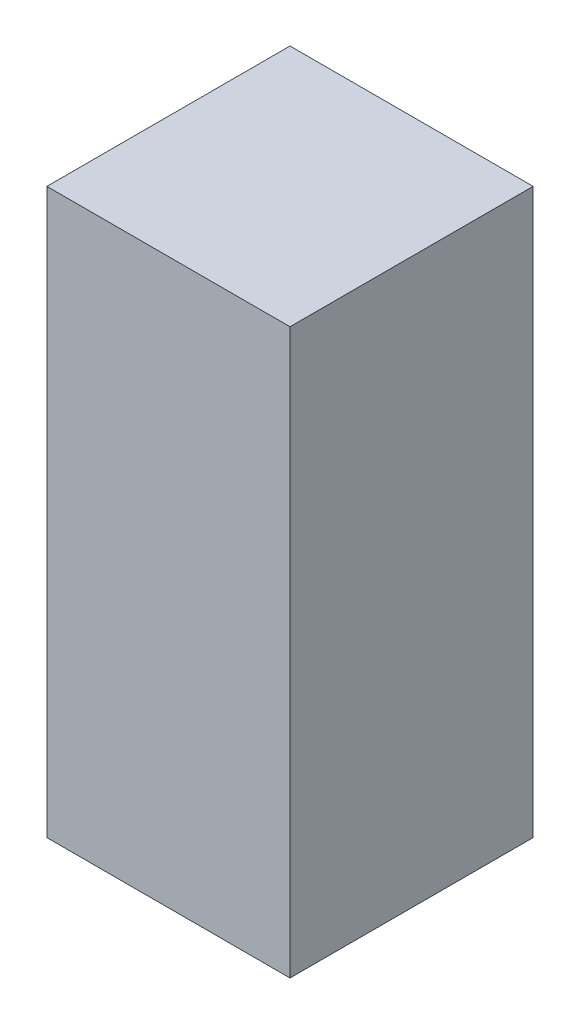
ISO-10303-21;
HEADER;
FILE_DESCRIPTION(('STEP AP214'),'2;1');
FILE_NAME('part.step','',(''),(''),'','','');
FILE_SCHEMA(('AUTOMOTIVE_DESIGN { 1 0 10303 214 1 1 1 1 }'));
ENDSEC;
DATA;
#1=APPLICATION_CONTEXT('core data for automotive mechanical design processes');
#2=APPLICATION_PROTOCOL_DEFINITION('international standard','automotive_design',2000,#1);
#3=PRODUCT_CONTEXT('',#1,'mechanical');
#4=PRODUCT('Part','Part','',(#3));
#5=PRODUCT_RELATED_PRODUCT_CATEGORY('part','',(#4));
#6=PRODUCT_DEFINITION_FORMATION('','',#4);
#7=PRODUCT_DEFINITION_CONTEXT('part definition',#1,'design');
#8=PRODUCT_DEFINITION('design','',#6,#7);
#9=PRODUCT_DEFINITION_SHAPE('','',#8);
#10=(LENGTH_UNIT() NAMED_UNIT(*) SI_UNIT(.MILLI.,.METRE.));
#11=(NAMED_UNIT(*) PLANE_ANGLE_UNIT() SI_UNIT($,.RADIAN.));
#12=(NAMED_UNIT(*) SI_UNIT($,.STERADIAN.) SOLID_ANGLE_UNIT());
#13=UNCERTAINTY_MEASURE_WITH_UNIT(LENGTH_MEASURE(1.E-05),#10,'distance_accuracy_value','');
#14=(GEOMETRIC_REPRESENTATION_CONTEXT(3) GLOBAL_UNCERTAINTY_ASSIGNED_CONTEXT((#13)) GLOBAL_UNIT_ASSIGNED_CONTEXT((#10,
#11,#12)) REPRESENTATION_CONTEXT('',''));
#15=CARTESIAN_POINT('',(0.,0.,0.));
#16=DIRECTION('',(0.,0.,1.));
#17=DIRECTION('',(1.,0.,0.));
#18=AXIS2_PLACEMENT_3D('',#15,#16,#17);
#19=CARTESIAN_POINT('',(12.7,58.928,12.7));
#20=DIRECTION('',(-1.,0.,0.));
#21=DIRECTION('',(0.,0.,1.));
#22=AXIS2_PLACEMENT_3D('',#19,#20,#21);
#23=PLANE('',#22);
#24=DIRECTION('',(0.,0.,-1.));
#25=VECTOR('',#24,1.);
#26=CARTESIAN_POINT('',(12.7,0.,12.7));
#27=LINE('',#26,#25);
#28=CARTESIAN_POINT('',(12.7,0.,12.7));
#29=VERTEX_POINT('',#28);
#30=CARTESIAN_POINT('',(12.7,0.,-12.7));
#31=VERTEX_POINT('',#30);
#32=EDGE_CURVE('E107',#29,#31,#27,.T.);
#33=ORIENTED_EDGE('',*,*,#32,.T.);
#34=DIRECTION('',(0.,-1.,0.));
#35=VECTOR('',#34,1.);
#36=CARTESIAN_POINT('',(12.7,58.928,-12.7));
#37=LINE('',#36,#35);
#38=CARTESIAN_POINT('',(12.7,58.928,-12.7));
#39=VERTEX_POINT('',#38);
#40=EDGE_CURVE('E11',#39,#31,#37,.T.);
#41=ORIENTED_EDGE('',*,*,#40,.F.);
#42=DIRECTION('',(0.,0.,-1.));
#43=VECTOR('',#42,1.);
#44=CARTESIAN_POINT('',(12.7,58.928,12.7));
#45=LINE('',#44,#43);
#46=CARTESIAN_POINT('',(12.7,58.928,12.7));
#47=VERTEX_POINT('',#46);
#48=EDGE_CURVE('E91',#47,#39,#45,.T.);
#49=ORIENTED_EDGE('',*,*,#48,.F.);
#50=DIRECTION('',(0.,-1.,0.));
#51=VECTOR('',#50,1.);
#52=CARTESIAN_POINT('',(12.7,58.928,12.7));
#53=LINE('',#52,#51);
#54=EDGE_CURVE('E103',#47,#29,#53,.T.);
#55=ORIENTED_EDGE('',*,*,#54,.T.);
#56=EDGE_LOOP('',(#33,#41,#49,#55));
#57=FACE_BOUND('',#56,.T.);
#58=ADVANCED_FACE('F39',(#57),#23,.F.);
#59=CARTESIAN_POINT('',(-12.7,58.928,-12.7));
#60=DIRECTION('',(0.,0.,1.));
#61=DIRECTION('',(1.,0.,0.));
#62=AXIS2_PLACEMENT_3D('',#59,#60,#61);
#63=PLANE('',#62);
#64=DIRECTION('',(-1.,0.,0.));
#65=VECTOR('',#64,1.);
#66=CARTESIAN_POINT('',(-12.7,0.,-12.7));
#67=LINE('',#66,#65);
#68=CARTESIAN_POINT('',(-12.7,0.,-12.7));
#69=VERTEX_POINT('',#68);
#70=EDGE_CURVE('E96',#31,#69,#67,.T.);
#71=ORIENTED_EDGE('',*,*,#70,.T.);
#72=DIRECTION('',(0.,-1.,0.));
#73=VECTOR('',#72,1.);
#74=CARTESIAN_POINT('',(-12.7,58.928,-12.7));
#75=LINE('',#74,#73);
#76=CARTESIAN_POINT('',(-12.7,58.928,-12.7));
#77=VERTEX_POINT('',#76);
#78=EDGE_CURVE('E48',#77,#69,#75,.T.);
#79=ORIENTED_EDGE('',*,*,#78,.F.);
#80=DIRECTION('',(-1.,0.,0.));
#81=VECTOR('',#80,1.);
#82=CARTESIAN_POINT('',(-12.7,58.928,-12.7));
#83=LINE('',#82,#81);
#84=EDGE_CURVE('E86',#39,#77,#83,.T.);
#85=ORIENTED_EDGE('',*,*,#84,.F.);
#86=ORIENTED_EDGE('',*,*,#40,.T.);
#87=EDGE_LOOP('',(#71,#79,#85,#86));
#88=FACE_BOUND('',#87,.T.);
#89=ADVANCED_FACE('F95',(#88),#63,.F.);
#90=CARTESIAN_POINT('',(-12.7,58.928,12.7));
#91=DIRECTION('',(1.,0.,0.));
#92=DIRECTION('',(0.,0.,-1.));
#93=AXIS2_PLACEMENT_3D('',#90,#91,#92);
#94=PLANE('',#93);
#95=DIRECTION('',(0.,0.,1.));
#96=VECTOR('',#95,1.);
#97=CARTESIAN_POINT('',(-12.7,0.,12.7));
#98=LINE('',#97,#96);
#99=CARTESIAN_POINT('',(-12.7,0.,12.7));
#100=VERTEX_POINT('',#99);
#101=EDGE_CURVE('E73',#69,#100,#98,.T.);
#102=ORIENTED_EDGE('',*,*,#101,.T.);
#103=DIRECTION('',(0.,-1.,0.));
#104=VECTOR('',#103,1.);
#105=CARTESIAN_POINT('',(-12.7,58.928,12.7));
#106=LINE('',#105,#104);
#107=CARTESIAN_POINT('',(-12.7,58.928,12.7));
#108=VERTEX_POINT('',#107);
#109=EDGE_CURVE('E98',#108,#100,#106,.T.);
#110=ORIENTED_EDGE('',*,*,#109,.F.);
#111=DIRECTION('',(0.,0.,1.));
#112=VECTOR('',#111,1.);
#113=CARTESIAN_POINT('',(-12.7,58.928,12.7));
#114=LINE('',#113,#112);
#115=EDGE_CURVE('E89',#77,#108,#114,.T.);
#116=ORIENTED_EDGE('',*,*,#115,.F.);
#117=ORIENTED_EDGE('',*,*,#78,.T.);
#118=EDGE_LOOP('',(#102,#110,#116,#117));
#119=FACE_BOUND('',#118,.T.);
#120=ADVANCED_FACE('F99',(#119),#94,.F.);
#121=CARTESIAN_POINT('',(-12.7,58.928,12.7));
#122=DIRECTION('',(0.,0.,-1.));
#123=DIRECTION('',(-1.,0.,0.));
#124=AXIS2_PLACEMENT_3D('',#121,#122,#123);
#125=PLANE('',#124);
#126=DIRECTION('',(1.,0.,0.));
#127=VECTOR('',#126,1.);
#128=CARTESIAN_POINT('',(-12.7,0.,12.7));
#129=LINE('',#128,#127);
#130=EDGE_CURVE('E79',#100,#29,#129,.T.);
#131=ORIENTED_EDGE('',*,*,#130,.T.);
#132=ORIENTED_EDGE('',*,*,#54,.F.);
#133=DIRECTION('',(1.,0.,0.));
#134=VECTOR('',#133,1.);
#135=CARTESIAN_POINT('',(-12.7,58.928,12.7));
#136=LINE('',#135,#134);
#137=EDGE_CURVE('E56',#108,#47,#136,.T.);
#138=ORIENTED_EDGE('',*,*,#137,.F.);
#139=ORIENTED_EDGE('',*,*,#109,.T.);
#140=EDGE_LOOP('',(#131,#132,#138,#139));
#141=FACE_BOUND('',#140,.T.);
#142=ADVANCED_FACE('F120',(#141),#125,.F.);
#143=CARTESIAN_POINT('',(0.,58.928,0.));
#144=DIRECTION('',(0.,-1.,0.));
#145=DIRECTION('',(0.,0.,-1.));
#146=AXIS2_PLACEMENT_3D('',#143,#144,#145);
#147=PLANE('',#146);
#148=ORIENTED_EDGE('',*,*,#48,.T.);
#149=ORIENTED_EDGE('',*,*,#84,.T.);
#150=ORIENTED_EDGE('',*,*,#115,.T.);
#151=ORIENTED_EDGE('',*,*,#137,.T.);
#152=EDGE_LOOP('',(#148,#149,#150,#151));
#153=FACE_BOUND('',#152,.T.);
#154=ADVANCED_FACE('F87',(#153),#147,.F.);
#155=CARTESIAN_POINT('',(0.,0.,0.));
#156=DIRECTION('',(0.,-1.,0.));
#157=DIRECTION('',(0.,0.,-1.));
#158=AXIS2_PLACEMENT_3D('',#155,#156,#157);
#159=PLANE('',#158);
#160=ORIENTED_EDGE('',*,*,#32,.F.);
#161=ORIENTED_EDGE('',*,*,#130,.F.);
#162=ORIENTED_EDGE('',*,*,#101,.F.);
#163=ORIENTED_EDGE('',*,*,#70,.F.);
#164=EDGE_LOOP('',(#160,#161,#162,#163));
#165=FACE_BOUND('',#164,.T.);
#166=ADVANCED_FACE('F123',(#165),#159,.T.);
#167=CLOSED_SHELL('',(#58,#89,#120,#142,#154,#166));
#168=MANIFOLD_SOLID_BREP('B2',#167);
#169=ADVANCED_BREP_SHAPE_REPRESENTATION('',(#18,#168),#14);
#170=SHAPE_DEFINITION_REPRESENTATION(#9,#169);
ENDSEC;
END-ISO-10303-21;
